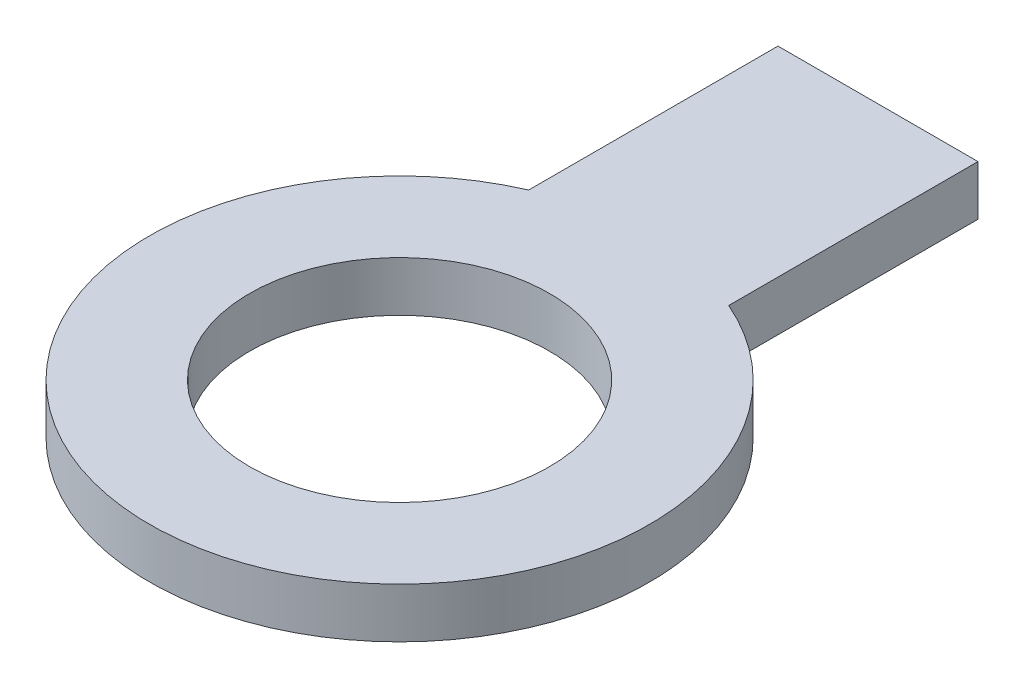
ISO-10303-21;
HEADER;
FILE_DESCRIPTION(('STEP AP214'),'2;1');
FILE_NAME('part.step','',(''),(''),'','','');
FILE_SCHEMA(('AUTOMOTIVE_DESIGN { 1 0 10303 214 1 1 1 1 }'));
ENDSEC;
DATA;
#1=APPLICATION_CONTEXT('core data for automotive mechanical design processes');
#2=APPLICATION_PROTOCOL_DEFINITION('international standard','automotive_design',2000,#1);
#3=PRODUCT_CONTEXT('',#1,'mechanical');
#4=PRODUCT('Part','Part','',(#3));
#5=PRODUCT_RELATED_PRODUCT_CATEGORY('part','',(#4));
#6=PRODUCT_DEFINITION_FORMATION('','',#4);
#7=PRODUCT_DEFINITION_CONTEXT('part definition',#1,'design');
#8=PRODUCT_DEFINITION('design','',#6,#7);
#9=PRODUCT_DEFINITION_SHAPE('','',#8);
#10=(LENGTH_UNIT() NAMED_UNIT(*) SI_UNIT(.MILLI.,.METRE.));
#11=(NAMED_UNIT(*) PLANE_ANGLE_UNIT() SI_UNIT($,.RADIAN.));
#12=(NAMED_UNIT(*) SI_UNIT($,.STERADIAN.) SOLID_ANGLE_UNIT());
#13=UNCERTAINTY_MEASURE_WITH_UNIT(LENGTH_MEASURE(1.E-05),#10,'distance_accuracy_value','');
#14=(GEOMETRIC_REPRESENTATION_CONTEXT(3) GLOBAL_UNCERTAINTY_ASSIGNED_CONTEXT((#13)) GLOBAL_UNIT_ASSIGNED_CONTEXT((#10,
#11,#12)) REPRESENTATION_CONTEXT('',''));
#15=CARTESIAN_POINT('',(0.,0.,0.));
#16=DIRECTION('',(0.,0.,1.));
#17=DIRECTION('',(1.,0.,0.));
#18=AXIS2_PLACEMENT_3D('',#15,#16,#17);
#19=CARTESIAN_POINT('',(0.,-2.,0.));
#20=DIRECTION('',(0.,1.,0.));
#21=DIRECTION('',(0.,0.,1.));
#22=AXIS2_PLACEMENT_3D('',#19,#20,#21);
#23=CYLINDRICAL_SURFACE('',#22,10.);
#24=DIRECTION('',(0.,1.,0.));
#25=VECTOR('',#24,1.);
#26=CARTESIAN_POINT('',(4.,-2.,-9.16515138991168));
#27=LINE('',#26,#25);
#28=CARTESIAN_POINT('',(4.,-2.,-9.16515138991168));
#29=VERTEX_POINT('',#28);
#30=CARTESIAN_POINT('',(4.,0.,-9.16515138991168));
#31=VERTEX_POINT('',#30);
#32=EDGE_CURVE('E56',#29,#31,#27,.T.);
#33=ORIENTED_EDGE('',*,*,#32,.T.);
#34=CARTESIAN_POINT('',(0.,0.,0.));
#35=DIRECTION('',(0.,1.,0.));
#36=DIRECTION('',(0.,0.,1.));
#37=AXIS2_PLACEMENT_3D('',#34,#35,#36);
#38=CIRCLE('',#37,10.);
#39=CARTESIAN_POINT('',(-4.,0.,-9.16515138991168));
#40=VERTEX_POINT('',#39);
#41=EDGE_CURVE('E36',#40,#31,#38,.T.);
#42=ORIENTED_EDGE('',*,*,#41,.F.);
#43=DIRECTION('',(0.,1.,0.));
#44=VECTOR('',#43,1.);
#45=CARTESIAN_POINT('',(-4.,-2.,-9.16515138991168));
#46=LINE('',#45,#44);
#47=CARTESIAN_POINT('',(-4.,-2.,-9.16515138991168));
#48=VERTEX_POINT('',#47);
#49=EDGE_CURVE('E86',#48,#40,#46,.T.);
#50=ORIENTED_EDGE('',*,*,#49,.F.);
#51=CARTESIAN_POINT('',(0.,-2.,0.));
#52=DIRECTION('',(0.,1.,0.));
#53=DIRECTION('',(0.,0.,1.));
#54=AXIS2_PLACEMENT_3D('',#51,#52,#53);
#55=CIRCLE('',#54,10.);
#56=EDGE_CURVE('E11',#48,#29,#55,.T.);
#57=ORIENTED_EDGE('',*,*,#56,.T.);
#58=EDGE_LOOP('',(#33,#42,#50,#57));
#59=FACE_BOUND('',#58,.T.);
#60=ADVANCED_FACE('F33',(#59),#23,.T.);
#61=CARTESIAN_POINT('',(0.,-2.,0.));
#62=DIRECTION('',(0.,1.,0.));
#63=DIRECTION('',(0.,0.,1.));
#64=AXIS2_PLACEMENT_3D('',#61,#62,#63);
#65=PLANE('',#64);
#66=CARTESIAN_POINT('',(0.,-2.,0.));
#67=DIRECTION('',(0.,1.,0.));
#68=DIRECTION('',(0.,0.,1.));
#69=AXIS2_PLACEMENT_3D('',#66,#67,#68);
#70=CIRCLE('',#69,6.);
#71=CARTESIAN_POINT('',(0.,-2.,6.));
#72=VERTEX_POINT('',#71);
#73=EDGE_CURVE('E101',#72,#72,#70,.T.);
#74=ORIENTED_EDGE('',*,*,#73,.T.);
#75=EDGE_LOOP('',(#74));
#76=FACE_BOUND('',#75,.T.);
#77=ORIENTED_EDGE('',*,*,#56,.F.);
#78=DIRECTION('',(0.,0.,1.));
#79=VECTOR('',#78,1.);
#80=CARTESIAN_POINT('',(-4.,-2.,-9.16515138991168));
#81=LINE('',#80,#79);
#82=CARTESIAN_POINT('',(-4.,-2.,-19.1351513899117));
#83=VERTEX_POINT('',#82);
#84=EDGE_CURVE('E84',#83,#48,#81,.T.);
#85=ORIENTED_EDGE('',*,*,#84,.F.);
#86=DIRECTION('',(-1.,0.,0.));
#87=VECTOR('',#86,1.);
#88=CARTESIAN_POINT('',(4.,-2.,-19.1351513899117));
#89=LINE('',#88,#87);
#90=CARTESIAN_POINT('',(4.,-2.,-19.1351513899117));
#91=VERTEX_POINT('',#90);
#92=EDGE_CURVE('E91',#91,#83,#89,.T.);
#93=ORIENTED_EDGE('',*,*,#92,.F.);
#94=DIRECTION('',(0.,0.,-1.));
#95=VECTOR('',#94,1.);
#96=CARTESIAN_POINT('',(4.,-2.,-9.16515138991168));
#97=LINE('',#96,#95);
#98=EDGE_CURVE('E94',#29,#91,#97,.T.);
#99=ORIENTED_EDGE('',*,*,#98,.F.);
#100=EDGE_LOOP('',(#77,#85,#93,#99));
#101=FACE_BOUND('',#100,.T.);
#102=ADVANCED_FACE('F90',(#76,#101),#65,.F.);
#103=CARTESIAN_POINT('',(0.,0.,0.));
#104=DIRECTION('',(0.,1.,0.));
#105=DIRECTION('',(0.,0.,1.));
#106=AXIS2_PLACEMENT_3D('',#103,#104,#105);
#107=PLANE('',#106);
#108=CARTESIAN_POINT('',(0.,0.,0.));
#109=DIRECTION('',(0.,1.,0.));
#110=DIRECTION('',(0.,0.,1.));
#111=AXIS2_PLACEMENT_3D('',#108,#109,#110);
#112=CIRCLE('',#111,6.);
#113=CARTESIAN_POINT('',(0.,0.,6.));
#114=VERTEX_POINT('',#113);
#115=EDGE_CURVE('E137',#114,#114,#112,.T.);
#116=ORIENTED_EDGE('',*,*,#115,.F.);
#117=EDGE_LOOP('',(#116));
#118=FACE_BOUND('',#117,.T.);
#119=ORIENTED_EDGE('',*,*,#41,.T.);
#120=DIRECTION('',(0.,0.,-1.));
#121=VECTOR('',#120,1.);
#122=CARTESIAN_POINT('',(4.,0.,-9.16515138991168));
#123=LINE('',#122,#121);
#124=CARTESIAN_POINT('',(4.,0.,-19.1351513899117));
#125=VERTEX_POINT('',#124);
#126=EDGE_CURVE('E71',#31,#125,#123,.T.);
#127=ORIENTED_EDGE('',*,*,#126,.T.);
#128=DIRECTION('',(-1.,0.,0.));
#129=VECTOR('',#128,1.);
#130=CARTESIAN_POINT('',(4.,0.,-19.1351513899117));
#131=LINE('',#130,#129);
#132=CARTESIAN_POINT('',(-4.,0.,-19.1351513899117));
#133=VERTEX_POINT('',#132);
#134=EDGE_CURVE('E100',#125,#133,#131,.T.);
#135=ORIENTED_EDGE('',*,*,#134,.T.);
#136=DIRECTION('',(0.,0.,1.));
#137=VECTOR('',#136,1.);
#138=CARTESIAN_POINT('',(-4.,0.,-9.16515138991168));
#139=LINE('',#138,#137);
#140=EDGE_CURVE('E47',#133,#40,#139,.T.);
#141=ORIENTED_EDGE('',*,*,#140,.T.);
#142=EDGE_LOOP('',(#119,#127,#135,#141));
#143=FACE_BOUND('',#142,.T.);
#144=ADVANCED_FACE('F107',(#118,#143),#107,.T.);
#145=CARTESIAN_POINT('',(4.,-2.,-9.16515138991168));
#146=DIRECTION('',(1.,0.,0.));
#147=DIRECTION('',(0.,0.,-1.));
#148=AXIS2_PLACEMENT_3D('',#145,#146,#147);
#149=PLANE('',#148);
#150=ORIENTED_EDGE('',*,*,#126,.F.);
#151=ORIENTED_EDGE('',*,*,#32,.F.);
#152=ORIENTED_EDGE('',*,*,#98,.T.);
#153=DIRECTION('',(0.,1.,0.));
#154=VECTOR('',#153,1.);
#155=CARTESIAN_POINT('',(4.,-2.,-19.1351513899117));
#156=LINE('',#155,#154);
#157=EDGE_CURVE('E77',#91,#125,#156,.T.);
#158=ORIENTED_EDGE('',*,*,#157,.T.);
#159=EDGE_LOOP('',(#150,#151,#152,#158));
#160=FACE_BOUND('',#159,.T.);
#161=ADVANCED_FACE('F106',(#160),#149,.T.);
#162=CARTESIAN_POINT('',(-4.,-2.,-9.16515138991168));
#163=DIRECTION('',(-1.,0.,0.));
#164=DIRECTION('',(0.,0.,1.));
#165=AXIS2_PLACEMENT_3D('',#162,#163,#164);
#166=PLANE('',#165);
#167=ORIENTED_EDGE('',*,*,#140,.F.);
#168=DIRECTION('',(0.,1.,0.));
#169=VECTOR('',#168,1.);
#170=CARTESIAN_POINT('',(-4.,-2.,-19.1351513899117));
#171=LINE('',#170,#169);
#172=EDGE_CURVE('E81',#83,#133,#171,.T.);
#173=ORIENTED_EDGE('',*,*,#172,.F.);
#174=ORIENTED_EDGE('',*,*,#84,.T.);
#175=ORIENTED_EDGE('',*,*,#49,.T.);
#176=EDGE_LOOP('',(#167,#173,#174,#175));
#177=FACE_BOUND('',#176,.T.);
#178=ADVANCED_FACE('F83',(#177),#166,.T.);
#179=CARTESIAN_POINT('',(4.,-2.,-19.1351513899117));
#180=DIRECTION('',(0.,0.,-1.));
#181=DIRECTION('',(-1.,0.,0.));
#182=AXIS2_PLACEMENT_3D('',#179,#180,#181);
#183=PLANE('',#182);
#184=ORIENTED_EDGE('',*,*,#134,.F.);
#185=ORIENTED_EDGE('',*,*,#157,.F.);
#186=ORIENTED_EDGE('',*,*,#92,.T.);
#187=ORIENTED_EDGE('',*,*,#172,.T.);
#188=EDGE_LOOP('',(#184,#185,#186,#187));
#189=FACE_BOUND('',#188,.T.);
#190=ADVANCED_FACE('F93',(#189),#183,.T.);
#191=CARTESIAN_POINT('',(0.,-2.,0.));
#192=DIRECTION('',(0.,1.,0.));
#193=DIRECTION('',(0.,0.,1.));
#194=AXIS2_PLACEMENT_3D('',#191,#192,#193);
#195=CYLINDRICAL_SURFACE('',#194,6.);
#196=ORIENTED_EDGE('',*,*,#73,.F.);
#197=EDGE_LOOP('',(#196));
#198=FACE_BOUND('',#197,.T.);
#199=ORIENTED_EDGE('',*,*,#115,.T.);
#200=EDGE_LOOP('',(#199));
#201=FACE_BOUND('',#200,.T.);
#202=ADVANCED_FACE('F126',(#198,#201),#195,.F.);
#203=CLOSED_SHELL('',(#60,#102,#144,#161,#178,#190,#202));
#204=MANIFOLD_SOLID_BREP('B2',#203);
#205=ADVANCED_BREP_SHAPE_REPRESENTATION('',(#18,#204),#14);
#206=SHAPE_DEFINITION_REPRESENTATION(#9,#205);
ENDSEC;
END-ISO-10303-21;
